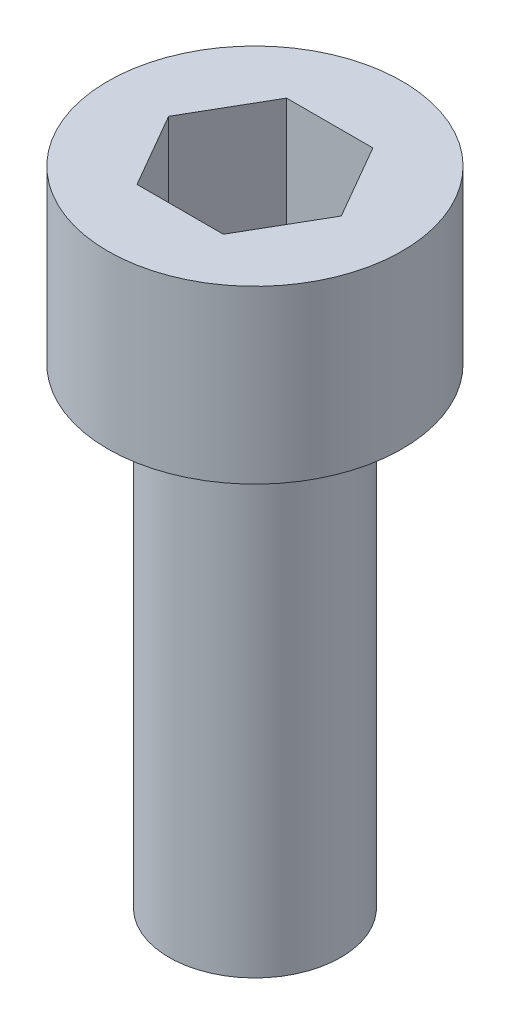
ISO-10303-21;
HEADER;
FILE_DESCRIPTION(('STEP AP214'),'2;1');
FILE_NAME('part.step','',(''),(''),'','','');
FILE_SCHEMA(('AUTOMOTIVE_DESIGN { 1 0 10303 214 1 1 1 1 }'));
ENDSEC;
DATA;
#1=APPLICATION_CONTEXT('core data for automotive mechanical design processes');
#2=APPLICATION_PROTOCOL_DEFINITION('international standard','automotive_design',2000,#1);
#3=PRODUCT_CONTEXT('',#1,'mechanical');
#4=PRODUCT('Part','Part','',(#3));
#5=PRODUCT_RELATED_PRODUCT_CATEGORY('part','',(#4));
#6=PRODUCT_DEFINITION_FORMATION('','',#4);
#7=PRODUCT_DEFINITION_CONTEXT('part definition',#1,'design');
#8=PRODUCT_DEFINITION('design','',#6,#7);
#9=PRODUCT_DEFINITION_SHAPE('','',#8);
#10=(LENGTH_UNIT() NAMED_UNIT(*) SI_UNIT(.MILLI.,.METRE.));
#11=(NAMED_UNIT(*) PLANE_ANGLE_UNIT() SI_UNIT($,.RADIAN.));
#12=(NAMED_UNIT(*) SI_UNIT($,.STERADIAN.) SOLID_ANGLE_UNIT());
#13=UNCERTAINTY_MEASURE_WITH_UNIT(LENGTH_MEASURE(1.E-05),#10,'distance_accuracy_value','');
#14=(GEOMETRIC_REPRESENTATION_CONTEXT(3) GLOBAL_UNCERTAINTY_ASSIGNED_CONTEXT((#13)) GLOBAL_UNIT_ASSIGNED_CONTEXT((#10,
#11,#12)) REPRESENTATION_CONTEXT('',''));
#15=CARTESIAN_POINT('',(0.,0.,0.));
#16=DIRECTION('',(0.,0.,1.));
#17=DIRECTION('',(1.,0.,0.));
#18=AXIS2_PLACEMENT_3D('',#15,#16,#17);
#19=CARTESIAN_POINT('',(0.,5.82,0.));
#20=DIRECTION('',(0.,-1.,0.));
#21=DIRECTION('',(0.,0.,-1.));
#22=AXIS2_PLACEMENT_3D('',#19,#20,#21);
#23=CYLINDRICAL_SURFACE('',#22,5.);
#24=CARTESIAN_POINT('',(0.,5.82,0.));
#25=DIRECTION('',(0.,1.,0.));
#26=DIRECTION('',(0.,0.,1.));
#27=AXIS2_PLACEMENT_3D('',#24,#25,#26);
#28=CIRCLE('',#27,5.);
#29=CARTESIAN_POINT('',(0.,5.82,5.));
#30=VERTEX_POINT('',#29);
#31=EDGE_CURVE('E41',#30,#30,#28,.T.);
#32=ORIENTED_EDGE('',*,*,#31,.F.);
#33=EDGE_LOOP('',(#32));
#34=FACE_BOUND('',#33,.T.);
#35=CARTESIAN_POINT('',(0.,0.,0.));
#36=DIRECTION('',(0.,1.,0.));
#37=DIRECTION('',(0.,0.,1.));
#38=AXIS2_PLACEMENT_3D('',#35,#36,#37);
#39=CIRCLE('',#38,5.);
#40=CARTESIAN_POINT('',(0.,0.,5.));
#41=VERTEX_POINT('',#40);
#42=EDGE_CURVE('E36',#41,#41,#39,.T.);
#43=ORIENTED_EDGE('',*,*,#42,.T.);
#44=EDGE_LOOP('',(#43));
#45=FACE_BOUND('',#44,.T.);
#46=ADVANCED_FACE('F33',(#34,#45),#23,.T.);
#47=CARTESIAN_POINT('',(0.,5.82,0.));
#48=DIRECTION('',(0.,1.,0.));
#49=DIRECTION('',(0.,0.,1.));
#50=AXIS2_PLACEMENT_3D('',#47,#48,#49);
#51=PLANE('',#50);
#52=DIRECTION('',(0.5,0.,-0.866025403784439));
#53=VECTOR('',#52,1.);
#54=CARTESIAN_POINT('',(1.46646968374165,5.82,2.54));
#55=LINE('',#54,#53);
#56=CARTESIAN_POINT('',(1.46646968374165,5.82,2.54));
#57=VERTEX_POINT('',#56);
#58=CARTESIAN_POINT('',(2.9329393674833,5.82,0.));
#59=VERTEX_POINT('',#58);
#60=EDGE_CURVE('E49',#57,#59,#55,.T.);
#61=ORIENTED_EDGE('',*,*,#60,.F.);
#62=DIRECTION('',(1.,0.,0.));
#63=VECTOR('',#62,1.);
#64=CARTESIAN_POINT('',(-1.46646968374165,5.82,2.54));
#65=LINE('',#64,#63);
#66=CARTESIAN_POINT('',(-1.46646968374165,5.82,2.54));
#67=VERTEX_POINT('',#66);
#68=EDGE_CURVE('E132',#67,#57,#65,.T.);
#69=ORIENTED_EDGE('',*,*,#68,.F.);
#70=DIRECTION('',(0.5,0.,0.866025403784439));
#71=VECTOR('',#70,1.);
#72=CARTESIAN_POINT('',(-2.9329393674833,5.82,0.));
#73=LINE('',#72,#71);
#74=CARTESIAN_POINT('',(-2.9329393674833,5.82,0.));
#75=VERTEX_POINT('',#74);
#76=EDGE_CURVE('E130',#75,#67,#73,.T.);
#77=ORIENTED_EDGE('',*,*,#76,.F.);
#78=DIRECTION('',(-0.5,0.,0.866025403784439));
#79=VECTOR('',#78,1.);
#80=CARTESIAN_POINT('',(-1.46646968374165,5.82,-2.54));
#81=LINE('',#80,#79);
#82=CARTESIAN_POINT('',(-1.46646968374165,5.82,-2.54));
#83=VERTEX_POINT('',#82);
#84=EDGE_CURVE('E97',#83,#75,#81,.T.);
#85=ORIENTED_EDGE('',*,*,#84,.F.);
#86=DIRECTION('',(-1.,0.,0.));
#87=VECTOR('',#86,1.);
#88=CARTESIAN_POINT('',(1.46646968374165,5.82,-2.54));
#89=LINE('',#88,#87);
#90=CARTESIAN_POINT('',(1.46646968374165,5.82,-2.54));
#91=VERTEX_POINT('',#90);
#92=EDGE_CURVE('E126',#91,#83,#89,.T.);
#93=ORIENTED_EDGE('',*,*,#92,.F.);
#94=DIRECTION('',(-0.5,0.,-0.866025403784439));
#95=VECTOR('',#94,1.);
#96=CARTESIAN_POINT('',(2.9329393674833,5.82,0.));
#97=LINE('',#96,#95);
#98=EDGE_CURVE('E123',#59,#91,#97,.T.);
#99=ORIENTED_EDGE('',*,*,#98,.F.);
#100=EDGE_LOOP('',(#61,#69,#77,#85,#93,#99));
#101=FACE_BOUND('',#100,.T.);
#102=ORIENTED_EDGE('',*,*,#31,.T.);
#103=EDGE_LOOP('',(#102));
#104=FACE_BOUND('',#103,.T.);
#105=ADVANCED_FACE('F153',(#101,#104),#51,.T.);
#106=CARTESIAN_POINT('',(0.,0.,0.));
#107=DIRECTION('',(0.,1.,0.));
#108=DIRECTION('',(0.,0.,1.));
#109=AXIS2_PLACEMENT_3D('',#106,#107,#108);
#110=PLANE('',#109);
#111=CARTESIAN_POINT('',(0.,0.,0.));
#112=DIRECTION('',(0.,-1.,0.));
#113=DIRECTION('',(0.,0.,-1.));
#114=AXIS2_PLACEMENT_3D('',#111,#112,#113);
#115=CIRCLE('',#114,2.92);
#116=CARTESIAN_POINT('',(0.,0.,-2.92));
#117=VERTEX_POINT('',#116);
#118=EDGE_CURVE('E11',#117,#117,#115,.T.);
#119=ORIENTED_EDGE('',*,*,#118,.F.);
#120=EDGE_LOOP('',(#119));
#121=FACE_BOUND('',#120,.T.);
#122=ORIENTED_EDGE('',*,*,#42,.F.);
#123=EDGE_LOOP('',(#122));
#124=FACE_BOUND('',#123,.T.);
#125=ADVANCED_FACE('F150',(#121,#124),#110,.F.);
#126=CARTESIAN_POINT('',(0.,-16.,0.));
#127=DIRECTION('',(0.,1.,0.));
#128=DIRECTION('',(0.,0.,1.));
#129=AXIS2_PLACEMENT_3D('',#126,#127,#128);
#130=CYLINDRICAL_SURFACE('',#129,2.92);
#131=CARTESIAN_POINT('',(0.,-16.,0.));
#132=DIRECTION('',(0.,-1.,0.));
#133=DIRECTION('',(0.,0.,-1.));
#134=AXIS2_PLACEMENT_3D('',#131,#132,#133);
#135=CIRCLE('',#134,2.92);
#136=CARTESIAN_POINT('',(0.,-16.,-2.92));
#137=VERTEX_POINT('',#136);
#138=EDGE_CURVE('E136',#137,#137,#135,.T.);
#139=ORIENTED_EDGE('',*,*,#138,.F.);
#140=EDGE_LOOP('',(#139));
#141=FACE_BOUND('',#140,.T.);
#142=ORIENTED_EDGE('',*,*,#118,.T.);
#143=EDGE_LOOP('',(#142));
#144=FACE_BOUND('',#143,.T.);
#145=ADVANCED_FACE('F152',(#141,#144),#130,.T.);
#146=CARTESIAN_POINT('',(0.,-16.,0.));
#147=DIRECTION('',(0.,-1.,0.));
#148=DIRECTION('',(0.,0.,-1.));
#149=AXIS2_PLACEMENT_3D('',#146,#147,#148);
#150=PLANE('',#149);
#151=ORIENTED_EDGE('',*,*,#138,.T.);
#152=EDGE_LOOP('',(#151));
#153=FACE_BOUND('',#152,.T.);
#154=ADVANCED_FACE('F159',(#153),#150,.T.);
#155=CARTESIAN_POINT('',(1.46646968374165,1.59,2.54));
#156=DIRECTION('',(0.866025403784439,0.,0.5));
#157=DIRECTION('',(0.5,0.,-0.866025403784439));
#158=AXIS2_PLACEMENT_3D('',#155,#156,#157);
#159=PLANE('',#158);
#160=ORIENTED_EDGE('',*,*,#60,.T.);
#161=DIRECTION('',(0.,1.,0.));
#162=VECTOR('',#161,1.);
#163=CARTESIAN_POINT('',(2.9329393674833,1.59,0.));
#164=LINE('',#163,#162);
#165=CARTESIAN_POINT('',(2.9329393674833,1.59,0.));
#166=VERTEX_POINT('',#165);
#167=EDGE_CURVE('E79',#166,#59,#164,.T.);
#168=ORIENTED_EDGE('',*,*,#167,.F.);
#169=DIRECTION('',(0.5,0.,-0.866025403784439));
#170=VECTOR('',#169,1.);
#171=CARTESIAN_POINT('',(1.46646968374165,1.59,2.54));
#172=LINE('',#171,#170);
#173=CARTESIAN_POINT('',(1.46646968374165,1.59,2.54));
#174=VERTEX_POINT('',#173);
#175=EDGE_CURVE('E134',#174,#166,#172,.T.);
#176=ORIENTED_EDGE('',*,*,#175,.F.);
#177=DIRECTION('',(0.,1.,0.));
#178=VECTOR('',#177,1.);
#179=CARTESIAN_POINT('',(1.46646968374165,1.59,2.54));
#180=LINE('',#179,#178);
#181=EDGE_CURVE('E57',#174,#57,#180,.T.);
#182=ORIENTED_EDGE('',*,*,#181,.T.);
#183=EDGE_LOOP('',(#160,#168,#176,#182));
#184=FACE_BOUND('',#183,.T.);
#185=ADVANCED_FACE('F184',(#184),#159,.F.);
#186=CARTESIAN_POINT('',(-1.46646968374165,1.59,2.54));
#187=DIRECTION('',(0.,0.,1.));
#188=DIRECTION('',(1.,0.,0.));
#189=AXIS2_PLACEMENT_3D('',#186,#187,#188);
#190=PLANE('',#189);
#191=ORIENTED_EDGE('',*,*,#68,.T.);
#192=ORIENTED_EDGE('',*,*,#181,.F.);
#193=DIRECTION('',(1.,0.,0.));
#194=VECTOR('',#193,1.);
#195=CARTESIAN_POINT('',(-1.46646968374165,1.59,2.54));
#196=LINE('',#195,#194);
#197=CARTESIAN_POINT('',(-1.46646968374165,1.59,2.54));
#198=VERTEX_POINT('',#197);
#199=EDGE_CURVE('E109',#198,#174,#196,.T.);
#200=ORIENTED_EDGE('',*,*,#199,.F.);
#201=DIRECTION('',(0.,1.,0.));
#202=VECTOR('',#201,1.);
#203=CARTESIAN_POINT('',(-1.46646968374165,1.59,2.54));
#204=LINE('',#203,#202);
#205=EDGE_CURVE('E101',#198,#67,#204,.T.);
#206=ORIENTED_EDGE('',*,*,#205,.T.);
#207=EDGE_LOOP('',(#191,#192,#200,#206));
#208=FACE_BOUND('',#207,.T.);
#209=ADVANCED_FACE('F189',(#208),#190,.F.);
#210=CARTESIAN_POINT('',(-2.9329393674833,1.59,0.));
#211=DIRECTION('',(-0.866025403784439,0.,0.5));
#212=DIRECTION('',(0.5,0.,0.866025403784439));
#213=AXIS2_PLACEMENT_3D('',#210,#211,#212);
#214=PLANE('',#213);
#215=ORIENTED_EDGE('',*,*,#76,.T.);
#216=ORIENTED_EDGE('',*,*,#205,.F.);
#217=DIRECTION('',(0.5,0.,0.866025403784439));
#218=VECTOR('',#217,1.);
#219=CARTESIAN_POINT('',(-2.9329393674833,1.59,0.));
#220=LINE('',#219,#218);
#221=CARTESIAN_POINT('',(-2.9329393674833,1.59,0.));
#222=VERTEX_POINT('',#221);
#223=EDGE_CURVE('E105',#222,#198,#220,.T.);
#224=ORIENTED_EDGE('',*,*,#223,.F.);
#225=DIRECTION('',(0.,1.,0.));
#226=VECTOR('',#225,1.);
#227=CARTESIAN_POINT('',(-2.9329393674833,1.59,0.));
#228=LINE('',#227,#226);
#229=EDGE_CURVE('E90',#222,#75,#228,.T.);
#230=ORIENTED_EDGE('',*,*,#229,.T.);
#231=EDGE_LOOP('',(#215,#216,#224,#230));
#232=FACE_BOUND('',#231,.T.);
#233=ADVANCED_FACE('F106',(#232),#214,.F.);
#234=CARTESIAN_POINT('',(-1.46646968374165,1.59,-2.54));
#235=DIRECTION('',(-0.866025403784439,0.,-0.5));
#236=DIRECTION('',(-0.5,0.,0.866025403784439));
#237=AXIS2_PLACEMENT_3D('',#234,#235,#236);
#238=PLANE('',#237);
#239=ORIENTED_EDGE('',*,*,#84,.T.);
#240=ORIENTED_EDGE('',*,*,#229,.F.);
#241=DIRECTION('',(-0.5,0.,0.866025403784439));
#242=VECTOR('',#241,1.);
#243=CARTESIAN_POINT('',(-1.46646968374165,1.59,-2.54));
#244=LINE('',#243,#242);
#245=CARTESIAN_POINT('',(-1.46646968374165,1.59,-2.54));
#246=VERTEX_POINT('',#245);
#247=EDGE_CURVE('E94',#246,#222,#244,.T.);
#248=ORIENTED_EDGE('',*,*,#247,.F.);
#249=DIRECTION('',(0.,1.,0.));
#250=VECTOR('',#249,1.);
#251=CARTESIAN_POINT('',(-1.46646968374165,1.59,-2.54));
#252=LINE('',#251,#250);
#253=EDGE_CURVE('E102',#246,#83,#252,.T.);
#254=ORIENTED_EDGE('',*,*,#253,.T.);
#255=EDGE_LOOP('',(#239,#240,#248,#254));
#256=FACE_BOUND('',#255,.T.);
#257=ADVANCED_FACE('F92',(#256),#238,.F.);
#258=CARTESIAN_POINT('',(1.46646968374165,1.59,-2.54));
#259=DIRECTION('',(0.,0.,-1.));
#260=DIRECTION('',(-1.,0.,0.));
#261=AXIS2_PLACEMENT_3D('',#258,#259,#260);
#262=PLANE('',#261);
#263=ORIENTED_EDGE('',*,*,#92,.T.);
#264=ORIENTED_EDGE('',*,*,#253,.F.);
#265=DIRECTION('',(-1.,0.,0.));
#266=VECTOR('',#265,1.);
#267=CARTESIAN_POINT('',(1.46646968374165,1.59,-2.54));
#268=LINE('',#267,#266);
#269=CARTESIAN_POINT('',(1.46646968374165,1.59,-2.54));
#270=VERTEX_POINT('',#269);
#271=EDGE_CURVE('E115',#270,#246,#268,.T.);
#272=ORIENTED_EDGE('',*,*,#271,.F.);
#273=DIRECTION('',(0.,1.,0.));
#274=VECTOR('',#273,1.);
#275=CARTESIAN_POINT('',(1.46646968374165,1.59,-2.54));
#276=LINE('',#275,#274);
#277=EDGE_CURVE('E139',#270,#91,#276,.T.);
#278=ORIENTED_EDGE('',*,*,#277,.T.);
#279=EDGE_LOOP('',(#263,#264,#272,#278));
#280=FACE_BOUND('',#279,.T.);
#281=ADVANCED_FACE('F214',(#280),#262,.F.);
#282=CARTESIAN_POINT('',(2.9329393674833,1.59,0.));
#283=DIRECTION('',(0.866025403784438,0.,-0.5));
#284=DIRECTION('',(-0.5,0.,-0.866025403784439));
#285=AXIS2_PLACEMENT_3D('',#282,#283,#284);
#286=PLANE('',#285);
#287=ORIENTED_EDGE('',*,*,#98,.T.);
#288=ORIENTED_EDGE('',*,*,#277,.F.);
#289=DIRECTION('',(-0.5,0.,-0.866025403784439));
#290=VECTOR('',#289,1.);
#291=CARTESIAN_POINT('',(2.9329393674833,1.59,0.));
#292=LINE('',#291,#290);
#293=EDGE_CURVE('E117',#166,#270,#292,.T.);
#294=ORIENTED_EDGE('',*,*,#293,.F.);
#295=ORIENTED_EDGE('',*,*,#167,.T.);
#296=EDGE_LOOP('',(#287,#288,#294,#295));
#297=FACE_BOUND('',#296,.T.);
#298=ADVANCED_FACE('F223',(#297),#286,.F.);
#299=CARTESIAN_POINT('',(0.,1.59,0.));
#300=DIRECTION('',(0.,1.,0.));
#301=DIRECTION('',(0.,0.,1.));
#302=AXIS2_PLACEMENT_3D('',#299,#300,#301);
#303=PLANE('',#302);
#304=ORIENTED_EDGE('',*,*,#175,.T.);
#305=ORIENTED_EDGE('',*,*,#293,.T.);
#306=ORIENTED_EDGE('',*,*,#271,.T.);
#307=ORIENTED_EDGE('',*,*,#247,.T.);
#308=ORIENTED_EDGE('',*,*,#223,.T.);
#309=ORIENTED_EDGE('',*,*,#199,.T.);
#310=EDGE_LOOP('',(#304,#305,#306,#307,#308,#309));
#311=FACE_BOUND('',#310,.T.);
#312=ADVANCED_FACE('F112',(#311),#303,.T.);
#313=CLOSED_SHELL('',(#46,#105,#125,#145,#154,#185,#209,#233,#257,#281,#298,#312));
#314=MANIFOLD_SOLID_BREP('B2',#313);
#315=ADVANCED_BREP_SHAPE_REPRESENTATION('',(#18,#314),#14);
#316=SHAPE_DEFINITION_REPRESENTATION(#9,#315);
ENDSEC;
END-ISO-10303-21;
